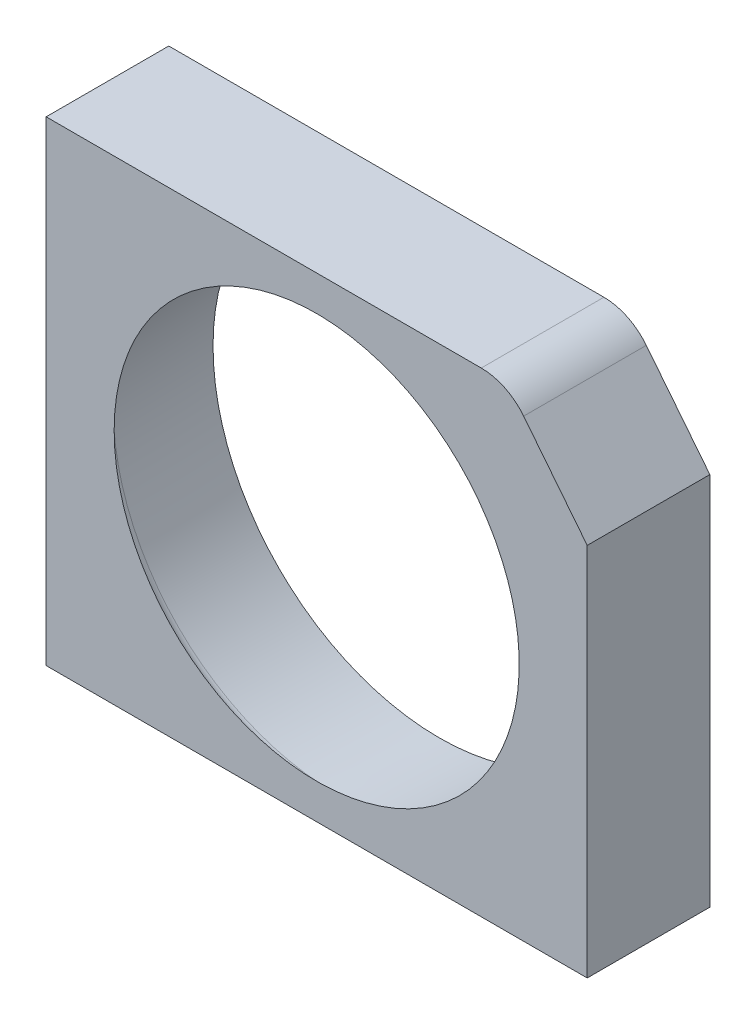
ISO-10303-21;
HEADER;
FILE_DESCRIPTION(('STEP AP214'),'2;1');
FILE_NAME('part.step','',(''),(''),'','','');
FILE_SCHEMA(('AUTOMOTIVE_DESIGN { 1 0 10303 214 1 1 1 1 }'));
ENDSEC;
DATA;
#1=APPLICATION_CONTEXT('core data for automotive mechanical design processes');
#2=APPLICATION_PROTOCOL_DEFINITION('international standard','automotive_design',2000,#1);
#3=PRODUCT_CONTEXT('',#1,'mechanical');
#4=PRODUCT('Part','Part','',(#3));
#5=PRODUCT_RELATED_PRODUCT_CATEGORY('part','',(#4));
#6=PRODUCT_DEFINITION_FORMATION('','',#4);
#7=PRODUCT_DEFINITION_CONTEXT('part definition',#1,'design');
#8=PRODUCT_DEFINITION('design','',#6,#7);
#9=PRODUCT_DEFINITION_SHAPE('','',#8);
#10=(LENGTH_UNIT() NAMED_UNIT(*) SI_UNIT(.MILLI.,.METRE.));
#11=(NAMED_UNIT(*) PLANE_ANGLE_UNIT() SI_UNIT($,.RADIAN.));
#12=(NAMED_UNIT(*) SI_UNIT($,.STERADIAN.) SOLID_ANGLE_UNIT());
#13=UNCERTAINTY_MEASURE_WITH_UNIT(LENGTH_MEASURE(1.E-05),#10,'distance_accuracy_value','');
#14=(GEOMETRIC_REPRESENTATION_CONTEXT(3) GLOBAL_UNCERTAINTY_ASSIGNED_CONTEXT((#13)) GLOBAL_UNIT_ASSIGNED_CONTEXT((#10,
#11,#12)) REPRESENTATION_CONTEXT('',''));
#15=CARTESIAN_POINT('',(0.,0.,0.));
#16=DIRECTION('',(0.,0.,1.));
#17=DIRECTION('',(1.,0.,0.));
#18=AXIS2_PLACEMENT_3D('',#15,#16,#17);
#19=CARTESIAN_POINT('',(0.,0.,82.55));
#20=DIRECTION('',(0.,0.,-1.));
#21=DIRECTION('',(-1.,0.,0.));
#22=AXIS2_PLACEMENT_3D('',#19,#20,#21);
#23=PLANE('',#22);
#24=DIRECTION('',(-1.,0.,0.));
#25=VECTOR('',#24,1.);
#26=CARTESIAN_POINT('',(0.,0.,82.55));
#27=LINE('',#26,#25);
#28=CARTESIAN_POINT('',(300.,0.,82.55));
#29=VERTEX_POINT('',#28);
#30=CARTESIAN_POINT('',(0.,0.,82.55));
#31=VERTEX_POINT('',#30);
#32=EDGE_CURVE('E131',#29,#31,#27,.T.);
#33=ORIENTED_EDGE('',*,*,#32,.T.);
#34=DIRECTION('',(0.,1.,0.));
#35=VECTOR('',#34,1.);
#36=CARTESIAN_POINT('',(0.,263.525,82.55));
#37=LINE('',#36,#35);
#38=CARTESIAN_POINT('',(0.,263.525,82.55));
#39=VERTEX_POINT('',#38);
#40=EDGE_CURVE('E127',#31,#39,#37,.T.);
#41=ORIENTED_EDGE('',*,*,#40,.T.);
#42=DIRECTION('',(-1.,0.,0.));
#43=VECTOR('',#42,1.);
#44=CARTESIAN_POINT('',(0.,263.525,82.55));
#45=LINE('',#44,#43);
#46=CARTESIAN_POINT('',(241.253264434507,263.525,82.55));
#47=VERTEX_POINT('',#46);
#48=EDGE_CURVE('E109',#47,#39,#45,.T.);
#49=ORIENTED_EDGE('',*,*,#48,.F.);
#50=CARTESIAN_POINT('',(241.253264434507,233.525,82.55));
#51=DIRECTION('',(0.,0.,-1.));
#52=DIRECTION('',(-1.,0.,0.));
#53=AXIS2_PLACEMENT_3D('',#50,#51,#52);
#54=CIRCLE('',#53,30.);
#55=CARTESIAN_POINT('',(264.758194807193,252.166841330061,82.55));
#56=VERTEX_POINT('',#55);
#57=EDGE_CURVE('E92',#47,#56,#54,.T.);
#58=ORIENTED_EDGE('',*,*,#57,.T.);
#59=DIRECTION('',(0.621394711002044,-0.783497679089534,0.));
#60=VECTOR('',#59,1.);
#61=CARTESIAN_POINT('',(264.758194807193,252.166841330061,82.55));
#62=LINE('',#61,#60);
#63=CARTESIAN_POINT('',(300.,207.73152173913,82.55));
#64=VERTEX_POINT('',#63);
#65=EDGE_CURVE('E106',#56,#64,#62,.T.);
#66=ORIENTED_EDGE('',*,*,#65,.T.);
#67=DIRECTION('',(0.,-1.,0.));
#68=VECTOR('',#67,1.);
#69=CARTESIAN_POINT('',(300.,0.,82.55));
#70=LINE('',#69,#68);
#71=EDGE_CURVE('E110',#64,#29,#70,.T.);
#72=ORIENTED_EDGE('',*,*,#71,.T.);
#73=EDGE_LOOP('',(#33,#41,#49,#58,#66,#72));
#74=FACE_BOUND('',#73,.T.);
#75=CARTESIAN_POINT('',(149.999999999996,131.762500000001,82.55));
#76=DIRECTION('',(0.,0.,-1.));
#77=DIRECTION('',(-1.,0.,0.));
#78=AXIS2_PLACEMENT_3D('',#75,#76,#77);
#79=CIRCLE('',#78,125.464805775742);
#80=CARTESIAN_POINT('',(24.5351942242544,131.762500000001,82.55));
#81=VERTEX_POINT('',#80);
#82=EDGE_CURVE('E115',#81,#81,#79,.F.);
#83=ORIENTED_EDGE('',*,*,#82,.T.);
#84=EDGE_LOOP('',(#83));
#85=FACE_BOUND('',#84,.T.);
#86=ADVANCED_FACE('F34',(#74,#85),#23,.T.);
#87=CARTESIAN_POINT('',(0.,263.525,0.));
#88=DIRECTION('',(0.,1.,0.));
#89=DIRECTION('',(0.,0.,1.));
#90=AXIS2_PLACEMENT_3D('',#87,#88,#89);
#91=PLANE('',#90);
#92=DIRECTION('',(0.,0.,-1.));
#93=VECTOR('',#92,1.);
#94=CARTESIAN_POINT('',(241.253264434507,263.525,286.76549888));
#95=LINE('',#94,#93);
#96=CARTESIAN_POINT('',(241.253264434507,263.525,150.542283063692));
#97=VERTEX_POINT('',#96);
#98=EDGE_CURVE('E11',#97,#47,#95,.T.);
#99=ORIENTED_EDGE('',*,*,#98,.T.);
#100=ORIENTED_EDGE('',*,*,#48,.T.);
#101=DIRECTION('',(0.,0.,-1.));
#102=VECTOR('',#101,1.);
#103=CARTESIAN_POINT('',(0.,263.525,286.76549888));
#104=LINE('',#103,#102);
#105=CARTESIAN_POINT('',(0.,263.525,150.542283063692));
#106=VERTEX_POINT('',#105);
#107=EDGE_CURVE('E42',#106,#39,#104,.T.);
#108=ORIENTED_EDGE('',*,*,#107,.F.);
#109=DIRECTION('',(-1.,0.,0.));
#110=VECTOR('',#109,1.);
#111=CARTESIAN_POINT('',(0.,263.525,150.542283063692));
#112=LINE('',#111,#110);
#113=EDGE_CURVE('E130',#97,#106,#112,.T.);
#114=ORIENTED_EDGE('',*,*,#113,.F.);
#115=EDGE_LOOP('',(#99,#100,#108,#114));
#116=FACE_BOUND('',#115,.T.);
#117=ADVANCED_FACE('F129',(#116),#91,.T.);
#118=CARTESIAN_POINT('',(0.,0.,286.76549888));
#119=DIRECTION('',(0.,1.,0.));
#120=DIRECTION('',(0.,0.,1.));
#121=AXIS2_PLACEMENT_3D('',#118,#119,#120);
#122=PLANE('',#121);
#123=ORIENTED_EDGE('',*,*,#32,.F.);
#124=DIRECTION('',(0.,0.,-1.));
#125=VECTOR('',#124,1.);
#126=CARTESIAN_POINT('',(300.,0.,286.76549888));
#127=LINE('',#126,#125);
#128=CARTESIAN_POINT('',(300.,0.,150.542283063692));
#129=VERTEX_POINT('',#128);
#130=EDGE_CURVE('E122',#129,#29,#127,.T.);
#131=ORIENTED_EDGE('',*,*,#130,.F.);
#132=DIRECTION('',(-1.,0.,0.));
#133=VECTOR('',#132,1.);
#134=CARTESIAN_POINT('',(0.,0.,150.542283063692));
#135=LINE('',#134,#133);
#136=CARTESIAN_POINT('',(0.,0.,150.542283063692));
#137=VERTEX_POINT('',#136);
#138=EDGE_CURVE('E49',#129,#137,#135,.T.);
#139=ORIENTED_EDGE('',*,*,#138,.T.);
#140=DIRECTION('',(0.,0.,-1.));
#141=VECTOR('',#140,1.);
#142=CARTESIAN_POINT('',(0.,0.,286.76549888));
#143=LINE('',#142,#141);
#144=EDGE_CURVE('E124',#137,#31,#143,.T.);
#145=ORIENTED_EDGE('',*,*,#144,.T.);
#146=EDGE_LOOP('',(#123,#131,#139,#145));
#147=FACE_BOUND('',#146,.T.);
#148=ADVANCED_FACE('F174',(#147),#122,.F.);
#149=CARTESIAN_POINT('',(0.,263.525,286.76549888));
#150=DIRECTION('',(1.,0.,0.));
#151=DIRECTION('',(0.,0.,-1.));
#152=AXIS2_PLACEMENT_3D('',#149,#150,#151);
#153=PLANE('',#152);
#154=ORIENTED_EDGE('',*,*,#40,.F.);
#155=ORIENTED_EDGE('',*,*,#144,.F.);
#156=DIRECTION('',(0.,1.,0.));
#157=VECTOR('',#156,1.);
#158=CARTESIAN_POINT('',(0.,263.525,150.542283063692));
#159=LINE('',#158,#157);
#160=EDGE_CURVE('E56',#137,#106,#159,.T.);
#161=ORIENTED_EDGE('',*,*,#160,.T.);
#162=ORIENTED_EDGE('',*,*,#107,.T.);
#163=EDGE_LOOP('',(#154,#155,#161,#162));
#164=FACE_BOUND('',#163,.T.);
#165=ADVANCED_FACE('F36',(#164),#153,.F.);
#166=CARTESIAN_POINT('',(300.,0.,286.76549888));
#167=DIRECTION('',(-1.,0.,0.));
#168=DIRECTION('',(0.,-1.,0.));
#169=AXIS2_PLACEMENT_3D('',#166,#167,#168);
#170=PLANE('',#169);
#171=ORIENTED_EDGE('',*,*,#71,.F.);
#172=DIRECTION('',(0.,0.,-1.));
#173=VECTOR('',#172,1.);
#174=CARTESIAN_POINT('',(300.,207.73152173913,286.76549888));
#175=LINE('',#174,#173);
#176=CARTESIAN_POINT('',(300.,207.73152173913,150.542283063692));
#177=VERTEX_POINT('',#176);
#178=EDGE_CURVE('E97',#177,#64,#175,.T.);
#179=ORIENTED_EDGE('',*,*,#178,.F.);
#180=DIRECTION('',(0.,-1.,0.));
#181=VECTOR('',#180,1.);
#182=CARTESIAN_POINT('',(300.,0.,150.542283063692));
#183=LINE('',#182,#181);
#184=EDGE_CURVE('E145',#177,#129,#183,.T.);
#185=ORIENTED_EDGE('',*,*,#184,.T.);
#186=ORIENTED_EDGE('',*,*,#130,.T.);
#187=EDGE_LOOP('',(#171,#179,#185,#186));
#188=FACE_BOUND('',#187,.T.);
#189=ADVANCED_FACE('F184',(#188),#170,.F.);
#190=CARTESIAN_POINT('',(241.253264434507,233.525,286.76549888));
#191=DIRECTION('',(0.,0.,-1.));
#192=DIRECTION('',(-1.,0.,0.));
#193=AXIS2_PLACEMENT_3D('',#190,#191,#192);
#194=CYLINDRICAL_SURFACE('',#193,30.);
#195=ORIENTED_EDGE('',*,*,#57,.F.);
#196=ORIENTED_EDGE('',*,*,#98,.F.);
#197=CARTESIAN_POINT('',(241.253264434507,233.525,150.542283063692));
#198=DIRECTION('',(0.,0.,-1.));
#199=DIRECTION('',(-1.,0.,0.));
#200=AXIS2_PLACEMENT_3D('',#197,#198,#199);
#201=CIRCLE('',#200,30.);
#202=CARTESIAN_POINT('',(264.758194807193,252.166841330061,150.542283063692));
#203=VERTEX_POINT('',#202);
#204=EDGE_CURVE('E94',#97,#203,#201,.T.);
#205=ORIENTED_EDGE('',*,*,#204,.T.);
#206=DIRECTION('',(0.,0.,-1.));
#207=VECTOR('',#206,1.);
#208=CARTESIAN_POINT('',(264.758194807193,252.166841330061,286.76549888));
#209=LINE('',#208,#207);
#210=EDGE_CURVE('E88',#203,#56,#209,.T.);
#211=ORIENTED_EDGE('',*,*,#210,.T.);
#212=EDGE_LOOP('',(#195,#196,#205,#211));
#213=FACE_BOUND('',#212,.T.);
#214=ADVANCED_FACE('F90',(#213),#194,.T.);
#215=CARTESIAN_POINT('',(264.758194807193,252.166841330061,286.76549888));
#216=DIRECTION('',(-0.783497679089534,-0.621394711002044,0.));
#217=DIRECTION('',(0.621394711002044,-0.783497679089534,0.));
#218=AXIS2_PLACEMENT_3D('',#215,#216,#217);
#219=PLANE('',#218);
#220=ORIENTED_EDGE('',*,*,#65,.F.);
#221=ORIENTED_EDGE('',*,*,#210,.F.);
#222=DIRECTION('',(0.621394711002044,-0.783497679089534,0.));
#223=VECTOR('',#222,1.);
#224=CARTESIAN_POINT('',(264.758194807193,252.166841330061,150.542283063692));
#225=LINE('',#224,#223);
#226=EDGE_CURVE('E143',#203,#177,#225,.T.);
#227=ORIENTED_EDGE('',*,*,#226,.T.);
#228=ORIENTED_EDGE('',*,*,#178,.T.);
#229=EDGE_LOOP('',(#220,#221,#227,#228));
#230=FACE_BOUND('',#229,.T.);
#231=ADVANCED_FACE('F112',(#230),#219,.F.);
#232=CARTESIAN_POINT('',(149.999999999997,131.762500000001,139.906228771618));
#233=DIRECTION('',(0.,0.,-1.));
#234=DIRECTION('',(-1.,0.,0.));
#235=AXIS2_PLACEMENT_3D('',#232,#233,#234);
#236=CONICAL_SURFACE('',#235,123.461882131892,0.0349065850398867);
#237=CARTESIAN_POINT('',(149.999999999997,131.762500000001,139.906228771618));
#238=DIRECTION('',(0.,0.,1.));
#239=DIRECTION('',(1.,0.,0.));
#240=AXIS2_PLACEMENT_3D('',#237,#238,#239);
#241=CIRCLE('',#240,123.461882131892);
#242=CARTESIAN_POINT('',(273.46188213189,131.762500000001,139.906228771616));
#243=VERTEX_POINT('',#242);
#244=EDGE_CURVE('E139',#243,#243,#241,.T.);
#245=ORIENTED_EDGE('',*,*,#244,.T.);
#246=EDGE_LOOP('',(#245));
#247=FACE_BOUND('',#246,.T.);
#248=ORIENTED_EDGE('',*,*,#82,.F.);
#249=EDGE_LOOP('',(#248));
#250=FACE_BOUND('',#249,.T.);
#251=ADVANCED_FACE('F160',(#247,#250),#236,.F.);
#252=CARTESIAN_POINT('',(0.,0.,150.542283063692));
#253=DIRECTION('',(0.,0.,-1.));
#254=DIRECTION('',(-1.,0.,0.));
#255=AXIS2_PLACEMENT_3D('',#252,#253,#254);
#256=PLANE('',#255);
#257=ORIENTED_EDGE('',*,*,#204,.F.);
#258=ORIENTED_EDGE('',*,*,#113,.T.);
#259=ORIENTED_EDGE('',*,*,#160,.F.);
#260=ORIENTED_EDGE('',*,*,#138,.F.);
#261=ORIENTED_EDGE('',*,*,#184,.F.);
#262=ORIENTED_EDGE('',*,*,#226,.F.);
#263=EDGE_LOOP('',(#257,#258,#259,#260,#261,#262));
#264=FACE_BOUND('',#263,.T.);
#265=CARTESIAN_POINT('',(149.999999999993,131.7625,150.542283063692));
#266=DIRECTION('',(0.,0.,-1.));
#267=DIRECTION('',(-1.,0.,0.));
#268=AXIS2_PLACEMENT_3D('',#265,#266,#267);
#269=CIRCLE('',#268,112.298492350913);
#270=CARTESIAN_POINT('',(37.7015076490804,131.7625,150.542283063692));
#271=VERTEX_POINT('',#270);
#272=EDGE_CURVE('E146',#271,#271,#269,.F.);
#273=ORIENTED_EDGE('',*,*,#272,.F.);
#274=EDGE_LOOP('',(#273));
#275=FACE_BOUND('',#274,.T.);
#276=ADVANCED_FACE('F157',(#264,#275),#256,.F.);
#277=CARTESIAN_POINT('',(149.999999999997,131.762500000001,139.592133301296));
#278=DIRECTION('',(0.,0.,1.));
#279=DIRECTION('',(1.,0.,0.));
#280=AXIS2_PLACEMENT_3D('',#277,#278,#279);
#281=TOROIDAL_SURFACE('',#280,114.46736468872,9.);
#282=ORIENTED_EDGE('',*,*,#244,.F.);
#283=EDGE_LOOP('',(#282));
#284=FACE_BOUND('',#283,.T.);
#285=CARTESIAN_POINT('',(149.999999999998,131.762500000001,147.74451663055));
#286=DIRECTION('',(0.,0.,1.));
#287=DIRECTION('',(1.,0.,0.));
#288=AXIS2_PLACEMENT_3D('',#285,#286,#287);
#289=CIRCLE('',#288,118.280322340321);
#290=CARTESIAN_POINT('',(268.280322340319,131.762500000001,147.744516630548));
#291=VERTEX_POINT('',#290);
#292=EDGE_CURVE('E98',#291,#291,#289,.T.);
#293=ORIENTED_EDGE('',*,*,#292,.T.);
#294=EDGE_LOOP('',(#293));
#295=FACE_BOUND('',#294,.T.);
#296=ADVANCED_FACE('F159',(#284,#295),#281,.F.);
#297=CARTESIAN_POINT('',(149.999999999998,131.7625,156.662637537934));
#298=DIRECTION('',(0.,0.,-1.));
#299=DIRECTION('',(-1.,0.,0.));
#300=AXIS2_PLACEMENT_3D('',#297,#298,#299);
#301=CONICAL_SURFACE('',#300,99.2127252525065,1.13331210913781);
#302=ORIENTED_EDGE('',*,*,#272,.T.);
#303=EDGE_LOOP('',(#302));
#304=FACE_BOUND('',#303,.T.);
#305=ORIENTED_EDGE('',*,*,#292,.F.);
#306=EDGE_LOOP('',(#305));
#307=FACE_BOUND('',#306,.T.);
#308=ADVANCED_FACE('F154',(#304,#307),#301,.F.);
#309=CLOSED_SHELL('',(#86,#117,#148,#165,#189,#214,#231,#251,#276,#296,#308));
#310=MANIFOLD_SOLID_BREP('B2',#309);
#311=ADVANCED_BREP_SHAPE_REPRESENTATION('',(#18,#310),#14);
#312=SHAPE_DEFINITION_REPRESENTATION(#9,#311);
ENDSEC;
END-ISO-10303-21;
